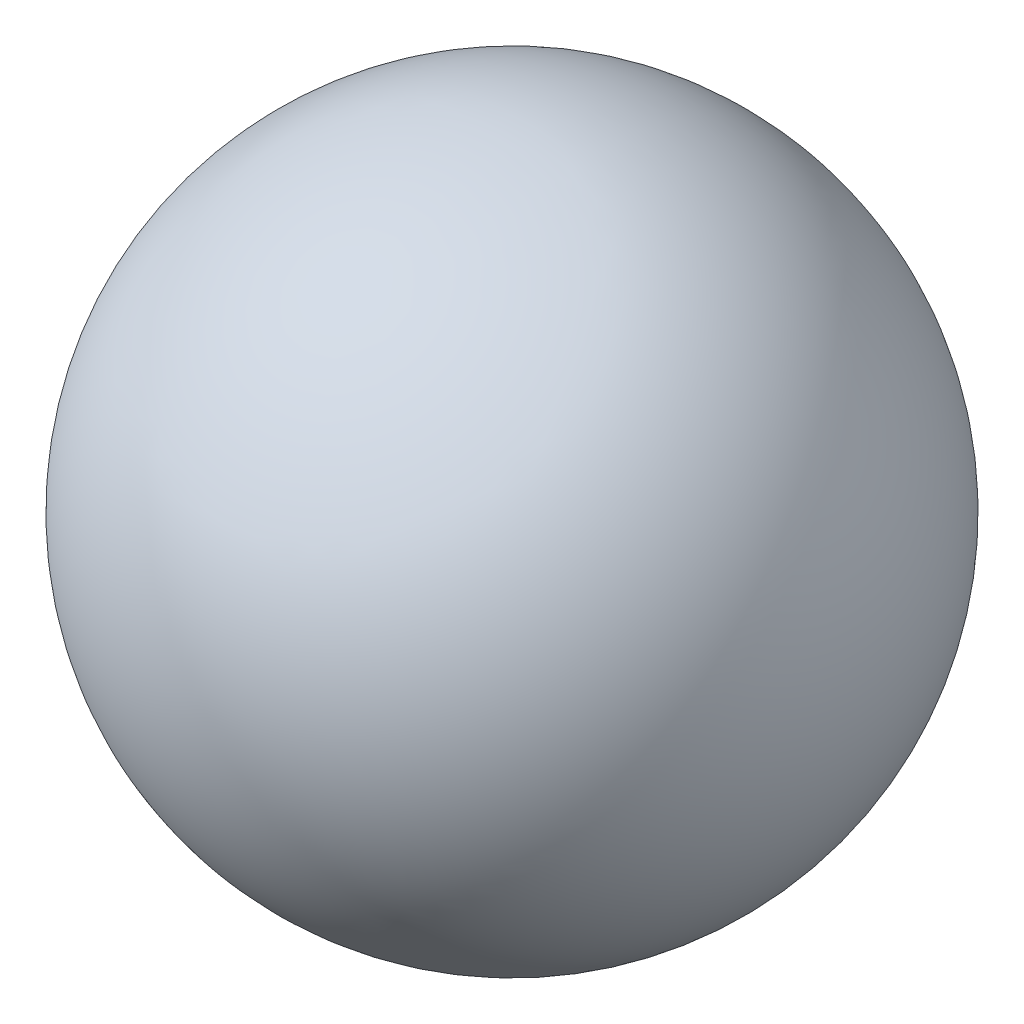
ISO-10303-21;
HEADER;
FILE_DESCRIPTION(('STEP AP214'),'2;1');
FILE_NAME('part.step','',(''),(''),'','','');
FILE_SCHEMA(('AUTOMOTIVE_DESIGN { 1 0 10303 214 1 1 1 1 }'));
ENDSEC;
DATA;
#1=APPLICATION_CONTEXT('core data for automotive mechanical design processes');
#2=APPLICATION_PROTOCOL_DEFINITION('international standard','automotive_design',2000,#1);
#3=PRODUCT_CONTEXT('',#1,'mechanical');
#4=PRODUCT('Part','Part','',(#3));
#5=PRODUCT_RELATED_PRODUCT_CATEGORY('part','',(#4));
#6=PRODUCT_DEFINITION_FORMATION('','',#4);
#7=PRODUCT_DEFINITION_CONTEXT('part definition',#1,'design');
#8=PRODUCT_DEFINITION('design','',#6,#7);
#9=PRODUCT_DEFINITION_SHAPE('','',#8);
#10=(LENGTH_UNIT() NAMED_UNIT(*) SI_UNIT(.MILLI.,.METRE.));
#11=(NAMED_UNIT(*) PLANE_ANGLE_UNIT() SI_UNIT($,.RADIAN.));
#12=(NAMED_UNIT(*) SI_UNIT($,.STERADIAN.) SOLID_ANGLE_UNIT());
#13=UNCERTAINTY_MEASURE_WITH_UNIT(LENGTH_MEASURE(1.E-05),#10,'distance_accuracy_value','');
#14=(GEOMETRIC_REPRESENTATION_CONTEXT(3) GLOBAL_UNCERTAINTY_ASSIGNED_CONTEXT((#13)) GLOBAL_UNIT_ASSIGNED_CONTEXT((#10,
#11,#12)) REPRESENTATION_CONTEXT('',''));
#15=CARTESIAN_POINT('',(0.,0.,0.));
#16=DIRECTION('',(0.,0.,1.));
#17=DIRECTION('',(1.,0.,0.));
#18=AXIS2_PLACEMENT_3D('',#15,#16,#17);
#19=CARTESIAN_POINT('',(64.16,19.3016172225726,-66.6441915067869));
#20=DIRECTION('',(0.,0.278189430012718,-0.960526231307193));
#21=DIRECTION('',(0.173648177666934,0.945933679562921,0.273963107482572));
#22=AXIS2_PLACEMENT_3D('',#19,#20,#21);
#23=SPHERICAL_SURFACE('',#22,7.15);
#24=CARTESIAN_POINT('',(64.16,21.2906716471635,-73.5119540606333));
#25=VERTEX_POINT('',#24);
#26=VERTEX_LOOP('',#25);
#27=FACE_BOUND('',#26,.T.);
#28=CARTESIAN_POINT('',(64.16,17.3125627979817,-59.7764289529405));
#29=VERTEX_POINT('',#28);
#30=VERTEX_LOOP('',#29);
#31=FACE_BOUND('',#30,.T.);
#32=ADVANCED_FACE('F15',(#27,#31),#23,.T.);
#33=CLOSED_SHELL('',(#32));
#34=MANIFOLD_SOLID_BREP('B1',#33);
#35=ADVANCED_BREP_SHAPE_REPRESENTATION('',(#18,#34),#14);
#36=SHAPE_DEFINITION_REPRESENTATION(#9,#35);
ENDSEC;
END-ISO-10303-21;
